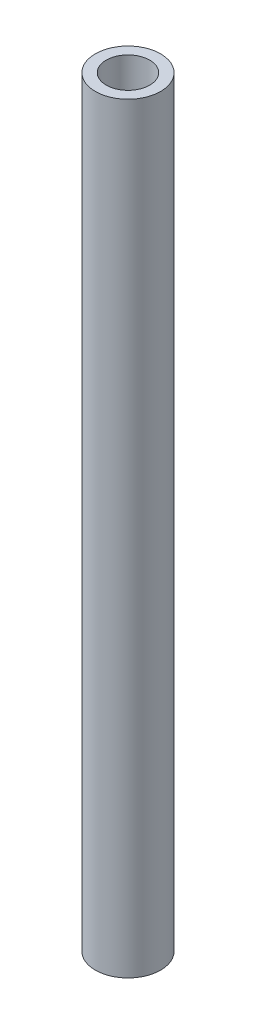
ISO-10303-21;
HEADER;
FILE_DESCRIPTION(('STEP AP214'),'2;1');
FILE_NAME('part.step','',(''),(''),'','','');
FILE_SCHEMA(('AUTOMOTIVE_DESIGN { 1 0 10303 214 1 1 1 1 }'));
ENDSEC;
DATA;
#1=APPLICATION_CONTEXT('core data for automotive mechanical design processes');
#2=APPLICATION_PROTOCOL_DEFINITION('international standard','automotive_design',2000,#1);
#3=PRODUCT_CONTEXT('',#1,'mechanical');
#4=PRODUCT('Part','Part','',(#3));
#5=PRODUCT_RELATED_PRODUCT_CATEGORY('part','',(#4));
#6=PRODUCT_DEFINITION_FORMATION('','',#4);
#7=PRODUCT_DEFINITION_CONTEXT('part definition',#1,'design');
#8=PRODUCT_DEFINITION('design','',#6,#7);
#9=PRODUCT_DEFINITION_SHAPE('','',#8);
#10=(LENGTH_UNIT() NAMED_UNIT(*) SI_UNIT(.MILLI.,.METRE.));
#11=(NAMED_UNIT(*) PLANE_ANGLE_UNIT() SI_UNIT($,.RADIAN.));
#12=(NAMED_UNIT(*) SI_UNIT($,.STERADIAN.) SOLID_ANGLE_UNIT());
#13=UNCERTAINTY_MEASURE_WITH_UNIT(LENGTH_MEASURE(1.E-05),#10,'distance_accuracy_value','');
#14=(GEOMETRIC_REPRESENTATION_CONTEXT(3) GLOBAL_UNCERTAINTY_ASSIGNED_CONTEXT((#13)) GLOBAL_UNIT_ASSIGNED_CONTEXT((#10,
#11,#12)) REPRESENTATION_CONTEXT('',''));
#15=CARTESIAN_POINT('',(0.,0.,0.));
#16=DIRECTION('',(0.,0.,1.));
#17=DIRECTION('',(1.,0.,0.));
#18=AXIS2_PLACEMENT_3D('',#15,#16,#17);
#19=CARTESIAN_POINT('',(0.,70.,0.));
#20=DIRECTION('',(0.,1.,0.));
#21=DIRECTION('',(0.,0.,1.));
#22=AXIS2_PLACEMENT_3D('',#19,#20,#21);
#23=PLANE('',#22);
#24=CARTESIAN_POINT('',(0.,70.,0.));
#25=DIRECTION('',(0.,1.,0.));
#26=DIRECTION('',(0.,0.,1.));
#27=AXIS2_PLACEMENT_3D('',#24,#25,#26);
#28=CIRCLE('',#27,3.);
#29=CARTESIAN_POINT('',(0.,70.,3.));
#30=VERTEX_POINT('',#29);
#31=EDGE_CURVE('E10',#30,#30,#28,.T.);
#32=ORIENTED_EDGE('',*,*,#31,.T.);
#33=EDGE_LOOP('',(#32));
#34=FACE_BOUND('',#33,.T.);
#35=CARTESIAN_POINT('',(0.,70.,0.));
#36=DIRECTION('',(0.,1.,0.));
#37=DIRECTION('',(0.,0.,1.));
#38=AXIS2_PLACEMENT_3D('',#35,#36,#37);
#39=CIRCLE('',#38,2.);
#40=CARTESIAN_POINT('',(0.,70.,2.));
#41=VERTEX_POINT('',#40);
#42=EDGE_CURVE('E48',#41,#41,#39,.T.);
#43=ORIENTED_EDGE('',*,*,#42,.F.);
#44=EDGE_LOOP('',(#43));
#45=FACE_BOUND('',#44,.T.);
#46=ADVANCED_FACE('F37',(#34,#45),#23,.T.);
#47=CARTESIAN_POINT('',(0.,0.,0.));
#48=DIRECTION('',(0.,1.,0.));
#49=DIRECTION('',(0.,0.,1.));
#50=AXIS2_PLACEMENT_3D('',#47,#48,#49);
#51=PLANE('',#50);
#52=CARTESIAN_POINT('',(0.,0.,0.));
#53=DIRECTION('',(0.,1.,0.));
#54=DIRECTION('',(0.,0.,1.));
#55=AXIS2_PLACEMENT_3D('',#52,#53,#54);
#56=CIRCLE('',#55,3.);
#57=CARTESIAN_POINT('',(0.,0.,3.));
#58=VERTEX_POINT('',#57);
#59=EDGE_CURVE('E41',#58,#58,#56,.T.);
#60=ORIENTED_EDGE('',*,*,#59,.F.);
#61=EDGE_LOOP('',(#60));
#62=FACE_BOUND('',#61,.T.);
#63=CARTESIAN_POINT('',(0.,0.,0.));
#64=DIRECTION('',(0.,1.,0.));
#65=DIRECTION('',(0.,0.,1.));
#66=AXIS2_PLACEMENT_3D('',#63,#64,#65);
#67=CIRCLE('',#66,2.);
#68=CARTESIAN_POINT('',(0.,0.,2.));
#69=VERTEX_POINT('',#68);
#70=EDGE_CURVE('E50',#69,#69,#67,.T.);
#71=ORIENTED_EDGE('',*,*,#70,.T.);
#72=EDGE_LOOP('',(#71));
#73=FACE_BOUND('',#72,.T.);
#74=ADVANCED_FACE('F60',(#62,#73),#51,.F.);
#75=CARTESIAN_POINT('',(0.,70.,0.));
#76=DIRECTION('',(0.,-1.,0.));
#77=DIRECTION('',(0.,0.,-1.));
#78=AXIS2_PLACEMENT_3D('',#75,#76,#77);
#79=CYLINDRICAL_SURFACE('',#78,3.);
#80=ORIENTED_EDGE('',*,*,#31,.F.);
#81=EDGE_LOOP('',(#80));
#82=FACE_BOUND('',#81,.T.);
#83=ORIENTED_EDGE('',*,*,#59,.T.);
#84=EDGE_LOOP('',(#83));
#85=FACE_BOUND('',#84,.T.);
#86=ADVANCED_FACE('F39',(#82,#85),#79,.T.);
#87=CARTESIAN_POINT('',(0.,70.,0.));
#88=DIRECTION('',(0.,-1.,0.));
#89=DIRECTION('',(0.,0.,-1.));
#90=AXIS2_PLACEMENT_3D('',#87,#88,#89);
#91=CYLINDRICAL_SURFACE('',#90,2.);
#92=ORIENTED_EDGE('',*,*,#42,.T.);
#93=EDGE_LOOP('',(#92));
#94=FACE_BOUND('',#93,.T.);
#95=ORIENTED_EDGE('',*,*,#70,.F.);
#96=EDGE_LOOP('',(#95));
#97=FACE_BOUND('',#96,.T.);
#98=ADVANCED_FACE('F56',(#94,#97),#91,.F.);
#99=CLOSED_SHELL('',(#46,#74,#86,#98));
#100=MANIFOLD_SOLID_BREP('B2',#99);
#101=ADVANCED_BREP_SHAPE_REPRESENTATION('',(#18,#100),#14);
#102=SHAPE_DEFINITION_REPRESENTATION(#9,#101);
ENDSEC;
END-ISO-10303-21;
